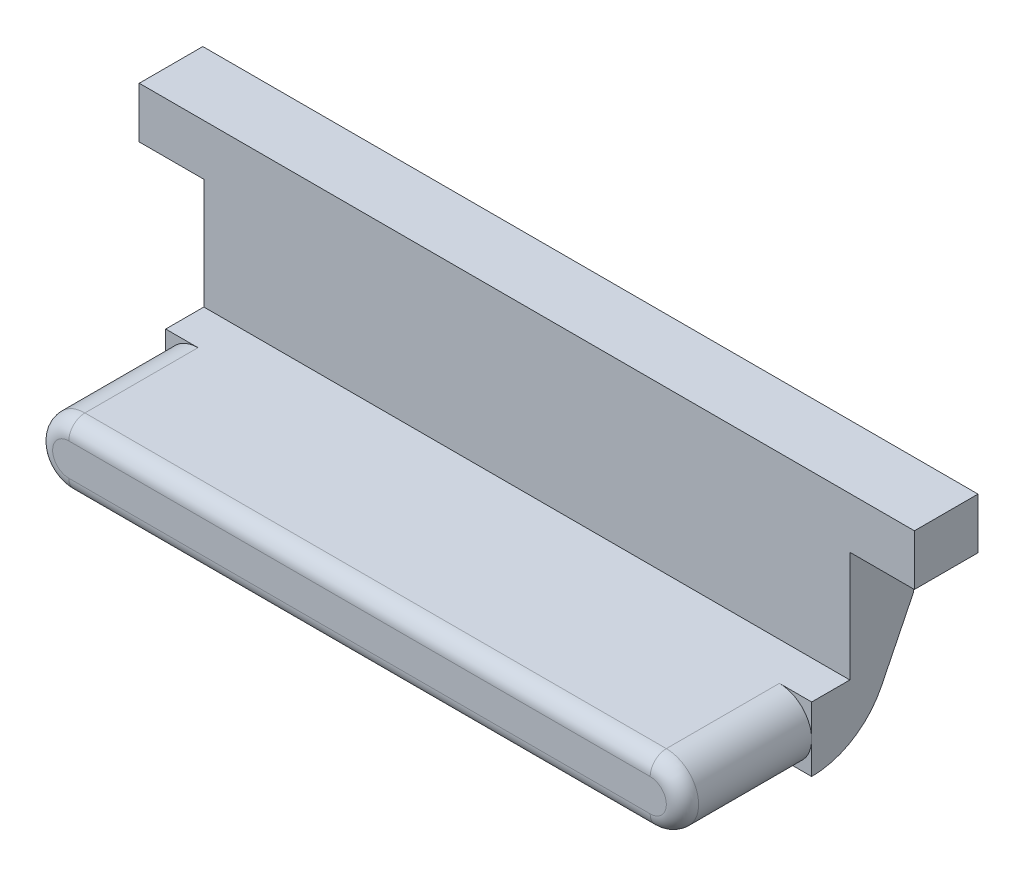
ISO-10303-21;
HEADER;
FILE_DESCRIPTION(('STEP AP214'),'2;1');
FILE_NAME('part.step','',(''),(''),'','','');
FILE_SCHEMA(('AUTOMOTIVE_DESIGN { 1 0 10303 214 1 1 1 1 }'));
ENDSEC;
DATA;
#1=APPLICATION_CONTEXT('core data for automotive mechanical design processes');
#2=APPLICATION_PROTOCOL_DEFINITION('international standard','automotive_design',2000,#1);
#3=PRODUCT_CONTEXT('',#1,'mechanical');
#4=PRODUCT('Part','Part','',(#3));
#5=PRODUCT_RELATED_PRODUCT_CATEGORY('part','',(#4));
#6=PRODUCT_DEFINITION_FORMATION('','',#4);
#7=PRODUCT_DEFINITION_CONTEXT('part definition',#1,'design');
#8=PRODUCT_DEFINITION('design','',#6,#7);
#9=PRODUCT_DEFINITION_SHAPE('','',#8);
#10=(LENGTH_UNIT() NAMED_UNIT(*) SI_UNIT(.MILLI.,.METRE.));
#11=(NAMED_UNIT(*) PLANE_ANGLE_UNIT() SI_UNIT($,.RADIAN.));
#12=(NAMED_UNIT(*) SI_UNIT($,.STERADIAN.) SOLID_ANGLE_UNIT());
#13=UNCERTAINTY_MEASURE_WITH_UNIT(LENGTH_MEASURE(1.E-05),#10,'distance_accuracy_value','');
#14=(GEOMETRIC_REPRESENTATION_CONTEXT(3) GLOBAL_UNCERTAINTY_ASSIGNED_CONTEXT((#13)) GLOBAL_UNIT_ASSIGNED_CONTEXT((#10,
#11,#12)) REPRESENTATION_CONTEXT('',''));
#15=CARTESIAN_POINT('',(0.,0.,0.));
#16=DIRECTION('',(0.,0.,1.));
#17=DIRECTION('',(1.,0.,0.));
#18=AXIS2_PLACEMENT_3D('',#15,#16,#17);
#19=CARTESIAN_POINT('',(-127.,216.547012861156,330.216510917726));
#20=DIRECTION('',(-1.,0.,0.));
#21=DIRECTION('',(0.,-1.,0.));
#22=AXIS2_PLACEMENT_3D('',#19,#20,#21);
#23=PLANE('',#22);
#24=DIRECTION('',(0.,-1.,0.));
#25=VECTOR('',#24,1.);
#26=CARTESIAN_POINT('',(-127.,190.5,340.6));
#27=LINE('',#26,#25);
#28=CARTESIAN_POINT('',(-127.,234.,340.6));
#29=VERTEX_POINT('',#28);
#30=CARTESIAN_POINT('',(-127.,190.5,340.6));
#31=VERTEX_POINT('',#30);
#32=EDGE_CURVE('E265',#29,#31,#27,.T.);
#33=ORIENTED_EDGE('',*,*,#32,.F.);
#34=DIRECTION('',(0.,0.,1.));
#35=VECTOR('',#34,1.);
#36=CARTESIAN_POINT('',(-127.,234.,315.5999992));
#37=LINE('',#36,#35);
#38=CARTESIAN_POINT('',(-127.,234.,315.5999992));
#39=VERTEX_POINT('',#38);
#40=EDGE_CURVE('E247',#39,#29,#37,.T.);
#41=ORIENTED_EDGE('',*,*,#40,.F.);
#42=DIRECTION('',(0.,1.,0.));
#43=VECTOR('',#42,1.);
#44=CARTESIAN_POINT('',(-127.,207.745235757354,315.5999992));
#45=LINE('',#44,#43);
#46=CARTESIAN_POINT('',(-127.,207.745235757354,315.5999992));
#47=VERTEX_POINT('',#46);
#48=EDGE_CURVE('E12',#47,#39,#45,.T.);
#49=ORIENTED_EDGE('',*,*,#48,.F.);
#50=DIRECTION('',(0.,-0.897542133073816,0.440928700990653));
#51=VECTOR('',#50,1.);
#52=CARTESIAN_POINT('',(-127.,165.1,336.55));
#53=LINE('',#52,#51);
#54=CARTESIAN_POINT('',(-127.,182.140493193805,328.17864644309));
#55=VERTEX_POINT('',#54);
#56=EDGE_CURVE('E270',#47,#55,#53,.T.);
#57=ORIENTED_EDGE('',*,*,#56,.T.);
#58=CARTESIAN_POINT('',(-127.,195.58,355.535730659179));
#59=DIRECTION('',(-1.,0.,0.));
#60=DIRECTION('',(0.,-1.,0.));
#61=AXIS2_PLACEMENT_3D('',#58,#59,#60);
#62=CIRCLE('',#61,30.4800000000001);
#63=CARTESIAN_POINT('',(-127.,165.1,355.535730659179));
#64=VERTEX_POINT('',#63);
#65=EDGE_CURVE('E275',#55,#64,#62,.T.);
#66=ORIENTED_EDGE('',*,*,#65,.T.);
#67=DIRECTION('',(0.,0.,1.));
#68=VECTOR('',#67,1.);
#69=CARTESIAN_POINT('',(-127.,165.1,406.4));
#70=LINE('',#69,#68);
#71=CARTESIAN_POINT('',(-127.,165.1,355.6));
#72=VERTEX_POINT('',#71);
#73=EDGE_CURVE('E278',#64,#72,#70,.T.);
#74=ORIENTED_EDGE('',*,*,#73,.T.);
#75=DIRECTION('',(0.,-1.,0.));
#76=VECTOR('',#75,1.);
#77=CARTESIAN_POINT('',(-127.,0.,355.6));
#78=LINE('',#77,#76);
#79=CARTESIAN_POINT('',(-127.,177.8,355.6));
#80=VERTEX_POINT('',#79);
#81=EDGE_CURVE('E276',#80,#72,#78,.T.);
#82=ORIENTED_EDGE('',*,*,#81,.F.);
#83=CARTESIAN_POINT('',(-127.,190.5,355.6));
#84=VERTEX_POINT('',#83);
#85=EDGE_CURVE('E272',#84,#80,#78,.T.);
#86=ORIENTED_EDGE('',*,*,#85,.F.);
#87=DIRECTION('',(0.,0.,-1.));
#88=VECTOR('',#87,1.);
#89=CARTESIAN_POINT('',(-127.,190.5,406.4));
#90=LINE('',#89,#88);
#91=EDGE_CURVE('E267',#84,#31,#90,.T.);
#92=ORIENTED_EDGE('',*,*,#91,.T.);
#93=EDGE_LOOP('',(#33,#41,#49,#57,#66,#74,#82,#86,#92));
#94=FACE_BOUND('',#93,.T.);
#95=ADVANCED_FACE('F35',(#94),#23,.T.);
#96=CARTESIAN_POINT('',(0.,0.,355.6));
#97=DIRECTION('',(0.,0.,1.));
#98=DIRECTION('',(1.,0.,0.));
#99=AXIS2_PLACEMENT_3D('',#96,#97,#98);
#100=PLANE('',#99);
#101=DIRECTION('',(-1.,0.,0.));
#102=VECTOR('',#101,1.);
#103=CARTESIAN_POINT('',(0.,190.5,355.6));
#104=LINE('',#103,#102);
#105=CARTESIAN_POINT('',(-114.3,190.5,355.6));
#106=VERTEX_POINT('',#105);
#107=EDGE_CURVE('E282',#106,#84,#104,.T.);
#108=ORIENTED_EDGE('',*,*,#107,.T.);
#109=ORIENTED_EDGE('',*,*,#85,.T.);
#110=CARTESIAN_POINT('',(-114.3,177.8,355.6));
#111=DIRECTION('',(0.,0.,1.));
#112=DIRECTION('',(1.,0.,0.));
#113=AXIS2_PLACEMENT_3D('',#110,#111,#112);
#114=CIRCLE('',#113,12.7);
#115=EDGE_CURVE('E297',#106,#80,#114,.T.);
#116=ORIENTED_EDGE('',*,*,#115,.F.);
#117=EDGE_LOOP('',(#108,#109,#116));
#118=FACE_BOUND('',#117,.T.);
#119=ADVANCED_FACE('F335',(#118),#100,.T.);
#120=CARTESIAN_POINT('',(-114.3,165.1,355.6));
#121=VERTEX_POINT('',#120);
#122=EDGE_CURVE('E301',#80,#121,#114,.T.);
#123=ORIENTED_EDGE('',*,*,#122,.F.);
#124=ORIENTED_EDGE('',*,*,#81,.T.);
#125=DIRECTION('',(1.,0.,0.));
#126=VECTOR('',#125,1.);
#127=CARTESIAN_POINT('',(-127.,165.1,355.6));
#128=LINE('',#127,#126);
#129=EDGE_CURVE('E294',#72,#121,#128,.T.);
#130=ORIENTED_EDGE('',*,*,#129,.T.);
#131=EDGE_LOOP('',(#123,#124,#130));
#132=FACE_BOUND('',#131,.T.);
#133=ADVANCED_FACE('F330',(#132),#100,.T.);
#134=CARTESIAN_POINT('',(-127.,165.1,336.55));
#135=DIRECTION('',(0.,0.440928700990653,0.897542133073816));
#136=DIRECTION('',(0.,-0.897542133073816,0.440928700990653));
#137=AXIS2_PLACEMENT_3D('',#134,#135,#136);
#138=PLANE('',#137);
#139=ORIENTED_EDGE('',*,*,#56,.F.);
#140=DIRECTION('',(1.,0.,0.));
#141=VECTOR('',#140,1.);
#142=CARTESIAN_POINT('',(-196.85,207.745235757354,315.5999992));
#143=LINE('',#142,#141);
#144=CARTESIAN_POINT('',(127.,207.745235757354,315.5999992));
#145=VERTEX_POINT('',#144);
#146=EDGE_CURVE('E286',#47,#145,#143,.T.);
#147=ORIENTED_EDGE('',*,*,#146,.T.);
#148=DIRECTION('',(0.,-0.897542133073816,0.440928700990653));
#149=VECTOR('',#148,1.);
#150=CARTESIAN_POINT('',(127.,165.1,336.55));
#151=LINE('',#150,#149);
#152=CARTESIAN_POINT('',(127.,182.140493193805,328.17864644309));
#153=VERTEX_POINT('',#152);
#154=EDGE_CURVE('E207',#145,#153,#151,.T.);
#155=ORIENTED_EDGE('',*,*,#154,.T.);
#156=DIRECTION('',(1.,0.,0.));
#157=VECTOR('',#156,1.);
#158=CARTESIAN_POINT('',(-159.230241468136,182.140493193805,328.178646443089));
#159=LINE('',#158,#157);
#160=EDGE_CURVE('E290',#55,#153,#159,.T.);
#161=ORIENTED_EDGE('',*,*,#160,.F.);
#162=EDGE_LOOP('',(#139,#147,#155,#161));
#163=FACE_BOUND('',#162,.T.);
#164=ADVANCED_FACE('F353',(#163),#138,.F.);
#165=CARTESIAN_POINT('',(-114.3,165.1,406.4));
#166=DIRECTION('',(0.,1.,0.));
#167=DIRECTION('',(-1.,0.,0.));
#168=AXIS2_PLACEMENT_3D('',#165,#166,#167);
#169=PLANE('',#168);
#170=ORIENTED_EDGE('',*,*,#73,.F.);
#171=DIRECTION('',(1.,0.,0.));
#172=VECTOR('',#171,1.);
#173=CARTESIAN_POINT('',(-159.230241468136,165.1,355.535730659179));
#174=LINE('',#173,#172);
#175=CARTESIAN_POINT('',(127.,165.1,355.535730659179));
#176=VERTEX_POINT('',#175);
#177=EDGE_CURVE('E292',#64,#176,#174,.T.);
#178=ORIENTED_EDGE('',*,*,#177,.T.);
#179=DIRECTION('',(0.,0.,1.));
#180=VECTOR('',#179,1.);
#181=CARTESIAN_POINT('',(127.,165.1,406.4));
#182=LINE('',#181,#180);
#183=CARTESIAN_POINT('',(127.,165.1,355.6));
#184=VERTEX_POINT('',#183);
#185=EDGE_CURVE('E217',#176,#184,#182,.T.);
#186=ORIENTED_EDGE('',*,*,#185,.T.);
#187=DIRECTION('',(-1.,0.,0.));
#188=VECTOR('',#187,1.);
#189=CARTESIAN_POINT('',(127.,165.1,355.6));
#190=LINE('',#189,#188);
#191=CARTESIAN_POINT('',(114.3,165.1,355.6));
#192=VERTEX_POINT('',#191);
#193=EDGE_CURVE('E222',#184,#192,#190,.T.);
#194=ORIENTED_EDGE('',*,*,#193,.T.);
#195=DIRECTION('',(0.,0.,-1.));
#196=VECTOR('',#195,1.);
#197=CARTESIAN_POINT('',(114.3,165.1,406.4));
#198=LINE('',#197,#196);
#199=CARTESIAN_POINT('',(114.3,165.1,400.05));
#200=VERTEX_POINT('',#199);
#201=EDGE_CURVE('E232',#200,#192,#198,.T.);
#202=ORIENTED_EDGE('',*,*,#201,.F.);
#203=DIRECTION('',(1.,0.,0.));
#204=VECTOR('',#203,1.);
#205=CARTESIAN_POINT('',(-114.3,165.1,400.05));
#206=LINE('',#205,#204);
#207=CARTESIAN_POINT('',(-114.3,165.1,400.05));
#208=VERTEX_POINT('',#207);
#209=EDGE_CURVE('E58',#200,#208,#206,.F.);
#210=ORIENTED_EDGE('',*,*,#209,.T.);
#211=DIRECTION('',(0.,0.,-1.));
#212=VECTOR('',#211,1.);
#213=CARTESIAN_POINT('',(-114.3,165.1,406.4));
#214=LINE('',#213,#212);
#215=EDGE_CURVE('E303',#208,#121,#214,.T.);
#216=ORIENTED_EDGE('',*,*,#215,.T.);
#217=ORIENTED_EDGE('',*,*,#129,.F.);
#218=EDGE_LOOP('',(#170,#178,#186,#194,#202,#210,#216,#217));
#219=FACE_BOUND('',#218,.T.);
#220=ADVANCED_FACE('F328',(#219),#169,.F.);
#221=CARTESIAN_POINT('',(-114.3,190.5,406.4));
#222=DIRECTION('',(0.,-1.,0.));
#223=DIRECTION('',(1.,0.,0.));
#224=AXIS2_PLACEMENT_3D('',#221,#222,#223);
#225=PLANE('',#224);
#226=ORIENTED_EDGE('',*,*,#91,.F.);
#227=ORIENTED_EDGE('',*,*,#107,.F.);
#228=DIRECTION('',(0.,0.,-1.));
#229=VECTOR('',#228,1.);
#230=CARTESIAN_POINT('',(-114.3,190.5,406.4));
#231=LINE('',#230,#229);
#232=CARTESIAN_POINT('',(-114.3,190.5,400.05));
#233=VERTEX_POINT('',#232);
#234=EDGE_CURVE('E300',#233,#106,#231,.T.);
#235=ORIENTED_EDGE('',*,*,#234,.F.);
#236=DIRECTION('',(-1.,0.,0.));
#237=VECTOR('',#236,1.);
#238=CARTESIAN_POINT('',(114.3,190.5,400.05));
#239=LINE('',#238,#237);
#240=CARTESIAN_POINT('',(114.3,190.5,400.05));
#241=VERTEX_POINT('',#240);
#242=EDGE_CURVE('E43',#233,#241,#239,.F.);
#243=ORIENTED_EDGE('',*,*,#242,.T.);
#244=DIRECTION('',(0.,0.,-1.));
#245=VECTOR('',#244,1.);
#246=CARTESIAN_POINT('',(114.3,190.5,406.4));
#247=LINE('',#246,#245);
#248=CARTESIAN_POINT('',(114.3,190.5,355.6));
#249=VERTEX_POINT('',#248);
#250=EDGE_CURVE('E229',#241,#249,#247,.T.);
#251=ORIENTED_EDGE('',*,*,#250,.T.);
#252=DIRECTION('',(1.,0.,0.));
#253=VECTOR('',#252,1.);
#254=CARTESIAN_POINT('',(0.,190.5,355.6));
#255=LINE('',#254,#253);
#256=CARTESIAN_POINT('',(127.,190.5,355.6));
#257=VERTEX_POINT('',#256);
#258=EDGE_CURVE('E220',#249,#257,#255,.T.);
#259=ORIENTED_EDGE('',*,*,#258,.T.);
#260=DIRECTION('',(0.,0.,-1.));
#261=VECTOR('',#260,1.);
#262=CARTESIAN_POINT('',(127.,190.5,406.4));
#263=LINE('',#262,#261);
#264=CARTESIAN_POINT('',(127.,190.5,340.6));
#265=VERTEX_POINT('',#264);
#266=EDGE_CURVE('E204',#257,#265,#263,.T.);
#267=ORIENTED_EDGE('',*,*,#266,.T.);
#268=DIRECTION('',(1.,0.,0.));
#269=VECTOR('',#268,1.);
#270=CARTESIAN_POINT('',(-196.85,190.5,340.6));
#271=LINE('',#270,#269);
#272=EDGE_CURVE('E280',#31,#265,#271,.T.);
#273=ORIENTED_EDGE('',*,*,#272,.F.);
#274=EDGE_LOOP('',(#226,#227,#235,#243,#251,#259,#267,#273));
#275=FACE_BOUND('',#274,.T.);
#276=ADVANCED_FACE('F337',(#275),#225,.F.);
#277=CARTESIAN_POINT('',(-159.230241468136,195.58,355.535730659179));
#278=DIRECTION('',(1.,0.,0.));
#279=DIRECTION('',(0.,0.,-1.));
#280=AXIS2_PLACEMENT_3D('',#277,#278,#279);
#281=CYLINDRICAL_SURFACE('',#280,30.4800000000001);
#282=ORIENTED_EDGE('',*,*,#65,.F.);
#283=ORIENTED_EDGE('',*,*,#160,.T.);
#284=CARTESIAN_POINT('',(127.,195.58,355.535730659179));
#285=DIRECTION('',(-1.,0.,0.));
#286=DIRECTION('',(0.,-1.,0.));
#287=AXIS2_PLACEMENT_3D('',#284,#285,#286);
#288=CIRCLE('',#287,30.4800000000001);
#289=EDGE_CURVE('E213',#153,#176,#288,.T.);
#290=ORIENTED_EDGE('',*,*,#289,.T.);
#291=ORIENTED_EDGE('',*,*,#177,.F.);
#292=EDGE_LOOP('',(#282,#283,#290,#291));
#293=FACE_BOUND('',#292,.T.);
#294=ADVANCED_FACE('F357',(#293),#281,.T.);
#295=CARTESIAN_POINT('',(-196.85,190.5,340.6));
#296=DIRECTION('',(0.,0.,1.));
#297=DIRECTION('',(1.,0.,0.));
#298=AXIS2_PLACEMENT_3D('',#295,#296,#297);
#299=PLANE('',#298);
#300=DIRECTION('',(1.,0.,0.));
#301=VECTOR('',#300,1.);
#302=CARTESIAN_POINT('',(-196.85,254.,340.6));
#303=LINE('',#302,#301);
#304=CARTESIAN_POINT('',(-152.4,254.,340.6));
#305=VERTEX_POINT('',#304);
#306=CARTESIAN_POINT('',(152.4,254.,340.6));
#307=VERTEX_POINT('',#306);
#308=EDGE_CURVE('E283',#305,#307,#303,.T.);
#309=ORIENTED_EDGE('',*,*,#308,.F.);
#310=DIRECTION('',(0.,1.,0.));
#311=VECTOR('',#310,1.);
#312=CARTESIAN_POINT('',(-152.4,254.,340.6));
#313=LINE('',#312,#311);
#314=CARTESIAN_POINT('',(-152.4,234.,340.6));
#315=VERTEX_POINT('',#314);
#316=EDGE_CURVE('E253',#315,#305,#313,.T.);
#317=ORIENTED_EDGE('',*,*,#316,.F.);
#318=DIRECTION('',(1.,0.,0.));
#319=VECTOR('',#318,1.);
#320=CARTESIAN_POINT('',(-152.4,234.,340.6));
#321=LINE('',#320,#319);
#322=EDGE_CURVE('E259',#315,#29,#321,.T.);
#323=ORIENTED_EDGE('',*,*,#322,.T.);
#324=ORIENTED_EDGE('',*,*,#32,.T.);
#325=ORIENTED_EDGE('',*,*,#272,.T.);
#326=DIRECTION('',(0.,-1.,0.));
#327=VECTOR('',#326,1.);
#328=CARTESIAN_POINT('',(127.,190.5,340.6));
#329=LINE('',#328,#327);
#330=CARTESIAN_POINT('',(127.,234.,340.6));
#331=VERTEX_POINT('',#330);
#332=EDGE_CURVE('E188',#331,#265,#329,.T.);
#333=ORIENTED_EDGE('',*,*,#332,.F.);
#334=DIRECTION('',(-1.,0.,0.));
#335=VECTOR('',#334,1.);
#336=CARTESIAN_POINT('',(152.4,234.,340.6));
#337=LINE('',#336,#335);
#338=CARTESIAN_POINT('',(152.4,234.,340.6));
#339=VERTEX_POINT('',#338);
#340=EDGE_CURVE('E189',#339,#331,#337,.T.);
#341=ORIENTED_EDGE('',*,*,#340,.F.);
#342=DIRECTION('',(0.,1.,0.));
#343=VECTOR('',#342,1.);
#344=CARTESIAN_POINT('',(152.4,254.,340.6));
#345=LINE('',#344,#343);
#346=EDGE_CURVE('E176',#339,#307,#345,.T.);
#347=ORIENTED_EDGE('',*,*,#346,.T.);
#348=EDGE_LOOP('',(#309,#317,#323,#324,#325,#333,#341,#347));
#349=FACE_BOUND('',#348,.T.);
#350=ADVANCED_FACE('F342',(#349),#299,.T.);
#351=CARTESIAN_POINT('',(-196.85,254.,340.6));
#352=DIRECTION('',(0.,1.,0.));
#353=DIRECTION('',(0.,0.,1.));
#354=AXIS2_PLACEMENT_3D('',#351,#352,#353);
#355=PLANE('',#354);
#356=DIRECTION('',(1.,0.,0.));
#357=VECTOR('',#356,1.);
#358=CARTESIAN_POINT('',(-196.85,254.,315.5999992));
#359=LINE('',#358,#357);
#360=CARTESIAN_POINT('',(-152.4,254.,315.5999992));
#361=VERTEX_POINT('',#360);
#362=CARTESIAN_POINT('',(152.4,254.,315.5999992));
#363=VERTEX_POINT('',#362);
#364=EDGE_CURVE('E194',#361,#363,#359,.T.);
#365=ORIENTED_EDGE('',*,*,#364,.F.);
#366=DIRECTION('',(0.,0.,-1.));
#367=VECTOR('',#366,1.);
#368=CARTESIAN_POINT('',(-152.4,254.,315.5999992));
#369=LINE('',#368,#367);
#370=EDGE_CURVE('E256',#305,#361,#369,.T.);
#371=ORIENTED_EDGE('',*,*,#370,.F.);
#372=ORIENTED_EDGE('',*,*,#308,.T.);
#373=DIRECTION('',(0.,0.,-1.));
#374=VECTOR('',#373,1.);
#375=CARTESIAN_POINT('',(152.4,254.,315.5999992));
#376=LINE('',#375,#374);
#377=EDGE_CURVE('E199',#307,#363,#376,.T.);
#378=ORIENTED_EDGE('',*,*,#377,.T.);
#379=EDGE_LOOP('',(#365,#371,#372,#378));
#380=FACE_BOUND('',#379,.T.);
#381=ADVANCED_FACE('F407',(#380),#355,.T.);
#382=CARTESIAN_POINT('',(-196.85,207.745235757354,315.5999992));
#383=DIRECTION('',(0.,0.,-1.));
#384=DIRECTION('',(-1.,0.,0.));
#385=AXIS2_PLACEMENT_3D('',#382,#383,#384);
#386=PLANE('',#385);
#387=ORIENTED_EDGE('',*,*,#146,.F.);
#388=ORIENTED_EDGE('',*,*,#48,.T.);
#389=DIRECTION('',(1.,0.,0.));
#390=VECTOR('',#389,1.);
#391=CARTESIAN_POINT('',(-152.4,234.,315.5999992));
#392=LINE('',#391,#390);
#393=CARTESIAN_POINT('',(-152.4,234.,315.5999992));
#394=VERTEX_POINT('',#393);
#395=EDGE_CURVE('E263',#394,#39,#392,.T.);
#396=ORIENTED_EDGE('',*,*,#395,.F.);
#397=DIRECTION('',(0.,-1.,0.));
#398=VECTOR('',#397,1.);
#399=CARTESIAN_POINT('',(-152.4,254.,315.5999992));
#400=LINE('',#399,#398);
#401=EDGE_CURVE('E248',#361,#394,#400,.T.);
#402=ORIENTED_EDGE('',*,*,#401,.F.);
#403=ORIENTED_EDGE('',*,*,#364,.T.);
#404=DIRECTION('',(0.,-1.,0.));
#405=VECTOR('',#404,1.);
#406=CARTESIAN_POINT('',(152.4,254.,315.5999992));
#407=LINE('',#406,#405);
#408=CARTESIAN_POINT('',(152.4,234.,315.5999992));
#409=VERTEX_POINT('',#408);
#410=EDGE_CURVE('E173',#363,#409,#407,.T.);
#411=ORIENTED_EDGE('',*,*,#410,.T.);
#412=DIRECTION('',(-1.,0.,0.));
#413=VECTOR('',#412,1.);
#414=CARTESIAN_POINT('',(152.4,234.,315.5999992));
#415=LINE('',#414,#413);
#416=CARTESIAN_POINT('',(127.,234.,315.5999992));
#417=VERTEX_POINT('',#416);
#418=EDGE_CURVE('E181',#409,#417,#415,.T.);
#419=ORIENTED_EDGE('',*,*,#418,.T.);
#420=DIRECTION('',(0.,1.,0.));
#421=VECTOR('',#420,1.);
#422=CARTESIAN_POINT('',(127.,207.745235757354,315.5999992));
#423=LINE('',#422,#421);
#424=EDGE_CURVE('E240',#145,#417,#423,.T.);
#425=ORIENTED_EDGE('',*,*,#424,.F.);
#426=EDGE_LOOP('',(#387,#388,#396,#402,#403,#411,#419,#425));
#427=FACE_BOUND('',#426,.T.);
#428=ADVANCED_FACE('F192',(#427),#386,.T.);
#429=CARTESIAN_POINT('',(-114.3,177.8,406.4));
#430=DIRECTION('',(0.,0.,1.));
#431=DIRECTION('',(1.,0.,0.));
#432=AXIS2_PLACEMENT_3D('',#429,#430,#431);
#433=PLANE('',#432);
#434=DIRECTION('',(1.,0.,0.));
#435=VECTOR('',#434,1.);
#436=CARTESIAN_POINT('',(114.3,171.45,406.4));
#437=LINE('',#436,#435);
#438=CARTESIAN_POINT('',(-114.3,171.45,406.4));
#439=VERTEX_POINT('',#438);
#440=CARTESIAN_POINT('',(114.3,171.45,406.4));
#441=VERTEX_POINT('',#440);
#442=EDGE_CURVE('E309',#439,#441,#437,.T.);
#443=ORIENTED_EDGE('',*,*,#442,.T.);
#444=CARTESIAN_POINT('',(114.3,177.8,406.4));
#445=DIRECTION('',(0.,0.,-1.));
#446=DIRECTION('',(-1.,0.,0.));
#447=AXIS2_PLACEMENT_3D('',#444,#445,#446);
#448=CIRCLE('',#447,6.34999999999996);
#449=CARTESIAN_POINT('',(114.3,184.15,406.4));
#450=VERTEX_POINT('',#449);
#451=EDGE_CURVE('E234',#450,#441,#448,.T.);
#452=ORIENTED_EDGE('',*,*,#451,.F.);
#453=DIRECTION('',(-1.,0.,0.));
#454=VECTOR('',#453,1.);
#455=CARTESIAN_POINT('',(-114.3,184.15,406.4));
#456=LINE('',#455,#454);
#457=CARTESIAN_POINT('',(-114.3,184.15,406.4));
#458=VERTEX_POINT('',#457);
#459=EDGE_CURVE('E305',#450,#458,#456,.T.);
#460=ORIENTED_EDGE('',*,*,#459,.T.);
#461=CARTESIAN_POINT('',(-114.3,177.8,406.4));
#462=DIRECTION('',(0.,0.,1.));
#463=DIRECTION('',(1.,0.,0.));
#464=AXIS2_PLACEMENT_3D('',#461,#462,#463);
#465=CIRCLE('',#464,6.34999999999996);
#466=EDGE_CURVE('E307',#458,#439,#465,.T.);
#467=ORIENTED_EDGE('',*,*,#466,.T.);
#468=EDGE_LOOP('',(#443,#452,#460,#467));
#469=FACE_BOUND('',#468,.T.);
#470=ADVANCED_FACE('F384',(#469),#433,.T.);
#471=CARTESIAN_POINT('',(-114.3,171.45,400.05));
#472=DIRECTION('',(-1.,0.,0.));
#473=DIRECTION('',(0.,-1.,0.));
#474=AXIS2_PLACEMENT_3D('',#471,#472,#473);
#475=CYLINDRICAL_SURFACE('',#474,6.35);
#476=ORIENTED_EDGE('',*,*,#209,.F.);
#477=CARTESIAN_POINT('',(114.3,171.45,400.05));
#478=DIRECTION('',(1.,0.,0.));
#479=DIRECTION('',(0.,0.,-1.));
#480=AXIS2_PLACEMENT_3D('',#477,#478,#479);
#481=CIRCLE('',#480,6.35);
#482=EDGE_CURVE('E243',#441,#200,#481,.T.);
#483=ORIENTED_EDGE('',*,*,#482,.F.);
#484=ORIENTED_EDGE('',*,*,#442,.F.);
#485=CARTESIAN_POINT('',(-114.3,171.45,400.05));
#486=DIRECTION('',(1.,0.,0.));
#487=DIRECTION('',(0.,0.,-1.));
#488=AXIS2_PLACEMENT_3D('',#485,#486,#487);
#489=CIRCLE('',#488,6.35);
#490=EDGE_CURVE('E315',#439,#208,#489,.T.);
#491=ORIENTED_EDGE('',*,*,#490,.T.);
#492=EDGE_LOOP('',(#476,#483,#484,#491));
#493=FACE_BOUND('',#492,.T.);
#494=ADVANCED_FACE('F382',(#493),#475,.T.);
#495=CARTESIAN_POINT('',(-114.3,184.15,400.05));
#496=DIRECTION('',(1.,0.,0.));
#497=DIRECTION('',(0.,1.,0.));
#498=AXIS2_PLACEMENT_3D('',#495,#496,#497);
#499=CYLINDRICAL_SURFACE('',#498,6.35);
#500=ORIENTED_EDGE('',*,*,#459,.F.);
#501=CARTESIAN_POINT('',(114.3,184.15,400.05));
#502=DIRECTION('',(1.,0.,0.));
#503=DIRECTION('',(0.,0.,-1.));
#504=AXIS2_PLACEMENT_3D('',#501,#502,#503);
#505=CIRCLE('',#504,6.35);
#506=EDGE_CURVE('E225',#241,#450,#505,.T.);
#507=ORIENTED_EDGE('',*,*,#506,.F.);
#508=ORIENTED_EDGE('',*,*,#242,.F.);
#509=CARTESIAN_POINT('',(-114.3,184.15,400.05));
#510=DIRECTION('',(1.,0.,0.));
#511=DIRECTION('',(0.,0.,-1.));
#512=AXIS2_PLACEMENT_3D('',#509,#510,#511);
#513=CIRCLE('',#512,6.35);
#514=EDGE_CURVE('E296',#233,#458,#513,.T.);
#515=ORIENTED_EDGE('',*,*,#514,.T.);
#516=EDGE_LOOP('',(#500,#507,#508,#515));
#517=FACE_BOUND('',#516,.T.);
#518=ADVANCED_FACE('F388',(#517),#499,.T.);
#519=CARTESIAN_POINT('',(-114.3,177.8,406.4));
#520=DIRECTION('',(0.,0.,-1.));
#521=DIRECTION('',(-1.,0.,0.));
#522=AXIS2_PLACEMENT_3D('',#519,#520,#521);
#523=CYLINDRICAL_SURFACE('',#522,12.7);
#524=CARTESIAN_POINT('',(-114.3,177.8,400.05));
#525=DIRECTION('',(0.,0.,1.));
#526=DIRECTION('',(1.,0.,0.));
#527=AXIS2_PLACEMENT_3D('',#524,#525,#526);
#528=CIRCLE('',#527,12.7);
#529=EDGE_CURVE('E50',#208,#233,#528,.F.);
#530=ORIENTED_EDGE('',*,*,#529,.T.);
#531=ORIENTED_EDGE('',*,*,#234,.T.);
#532=ORIENTED_EDGE('',*,*,#115,.T.);
#533=ORIENTED_EDGE('',*,*,#122,.T.);
#534=ORIENTED_EDGE('',*,*,#215,.F.);
#535=EDGE_LOOP('',(#530,#531,#532,#533,#534));
#536=FACE_BOUND('',#535,.T.);
#537=ADVANCED_FACE('F322',(#536),#523,.T.);
#538=CARTESIAN_POINT('',(-114.3,177.8,400.05));
#539=DIRECTION('',(0.,0.,1.));
#540=DIRECTION('',(1.,0.,0.));
#541=AXIS2_PLACEMENT_3D('',#538,#539,#540);
#542=DEGENERATE_TOROIDAL_SURFACE('',#541,6.34999999999996,6.35,.T.);
#543=ORIENTED_EDGE('',*,*,#514,.F.);
#544=ORIENTED_EDGE('',*,*,#529,.F.);
#545=ORIENTED_EDGE('',*,*,#490,.F.);
#546=ORIENTED_EDGE('',*,*,#466,.F.);
#547=EDGE_LOOP('',(#543,#544,#545,#546));
#548=FACE_BOUND('',#547,.T.);
#549=ADVANCED_FACE('F37',(#548),#542,.T.);
#550=CARTESIAN_POINT('',(-152.4,234.,315.5999992));
#551=DIRECTION('',(0.,1.,0.));
#552=DIRECTION('',(-1.,0.,0.));
#553=AXIS2_PLACEMENT_3D('',#550,#551,#552);
#554=PLANE('',#553);
#555=ORIENTED_EDGE('',*,*,#40,.T.);
#556=ORIENTED_EDGE('',*,*,#322,.F.);
#557=DIRECTION('',(0.,0.,1.));
#558=VECTOR('',#557,1.);
#559=CARTESIAN_POINT('',(-152.4,234.,315.5999992));
#560=LINE('',#559,#558);
#561=EDGE_CURVE('E251',#394,#315,#560,.T.);
#562=ORIENTED_EDGE('',*,*,#561,.F.);
#563=ORIENTED_EDGE('',*,*,#395,.T.);
#564=EDGE_LOOP('',(#555,#556,#562,#563));
#565=FACE_BOUND('',#564,.T.);
#566=ADVANCED_FACE('F347',(#565),#554,.F.);
#567=CARTESIAN_POINT('',(-152.4,0.,0.));
#568=DIRECTION('',(-1.,0.,0.));
#569=DIRECTION('',(0.,0.,1.));
#570=AXIS2_PLACEMENT_3D('',#567,#568,#569);
#571=PLANE('',#570);
#572=ORIENTED_EDGE('',*,*,#401,.T.);
#573=ORIENTED_EDGE('',*,*,#561,.T.);
#574=ORIENTED_EDGE('',*,*,#316,.T.);
#575=ORIENTED_EDGE('',*,*,#370,.T.);
#576=EDGE_LOOP('',(#572,#573,#574,#575));
#577=FACE_BOUND('',#576,.T.);
#578=ADVANCED_FACE('F470',(#577),#571,.T.);
#579=CARTESIAN_POINT('',(127.,216.547012861156,330.216510917726));
#580=DIRECTION('',(1.,0.,0.));
#581=DIRECTION('',(0.,-1.,0.));
#582=AXIS2_PLACEMENT_3D('',#579,#580,#581);
#583=PLANE('',#582);
#584=ORIENTED_EDGE('',*,*,#332,.T.);
#585=ORIENTED_EDGE('',*,*,#266,.F.);
#586=DIRECTION('',(0.,-1.,0.));
#587=VECTOR('',#586,1.);
#588=CARTESIAN_POINT('',(127.,0.,355.6));
#589=LINE('',#588,#587);
#590=CARTESIAN_POINT('',(127.,177.8,355.6));
#591=VERTEX_POINT('',#590);
#592=EDGE_CURVE('E210',#257,#591,#589,.T.);
#593=ORIENTED_EDGE('',*,*,#592,.T.);
#594=EDGE_CURVE('E214',#591,#184,#589,.T.);
#595=ORIENTED_EDGE('',*,*,#594,.T.);
#596=ORIENTED_EDGE('',*,*,#185,.F.);
#597=ORIENTED_EDGE('',*,*,#289,.F.);
#598=ORIENTED_EDGE('',*,*,#154,.F.);
#599=ORIENTED_EDGE('',*,*,#424,.T.);
#600=DIRECTION('',(0.,0.,1.));
#601=VECTOR('',#600,1.);
#602=CARTESIAN_POINT('',(127.,234.,315.5999992));
#603=LINE('',#602,#601);
#604=EDGE_CURVE('E184',#417,#331,#603,.T.);
#605=ORIENTED_EDGE('',*,*,#604,.T.);
#606=EDGE_LOOP('',(#584,#585,#593,#595,#596,#597,#598,#599,#605));
#607=FACE_BOUND('',#606,.T.);
#608=ADVANCED_FACE('F363',(#607),#583,.T.);
#609=CARTESIAN_POINT('',(0.,0.,355.6));
#610=DIRECTION('',(0.,0.,1.));
#611=DIRECTION('',(-1.,0.,0.));
#612=AXIS2_PLACEMENT_3D('',#609,#610,#611);
#613=PLANE('',#612);
#614=ORIENTED_EDGE('',*,*,#258,.F.);
#615=CARTESIAN_POINT('',(114.3,177.8,355.6));
#616=DIRECTION('',(0.,0.,-1.));
#617=DIRECTION('',(-1.,0.,0.));
#618=AXIS2_PLACEMENT_3D('',#615,#616,#617);
#619=CIRCLE('',#618,12.7);
#620=EDGE_CURVE('E226',#249,#591,#619,.T.);
#621=ORIENTED_EDGE('',*,*,#620,.T.);
#622=ORIENTED_EDGE('',*,*,#592,.F.);
#623=EDGE_LOOP('',(#614,#621,#622));
#624=FACE_BOUND('',#623,.T.);
#625=ADVANCED_FACE('F375',(#624),#613,.T.);
#626=EDGE_CURVE('E230',#591,#192,#619,.T.);
#627=ORIENTED_EDGE('',*,*,#626,.T.);
#628=ORIENTED_EDGE('',*,*,#193,.F.);
#629=ORIENTED_EDGE('',*,*,#594,.F.);
#630=EDGE_LOOP('',(#627,#628,#629));
#631=FACE_BOUND('',#630,.T.);
#632=ADVANCED_FACE('F367',(#631),#613,.T.);
#633=CARTESIAN_POINT('',(114.3,177.8,406.4));
#634=DIRECTION('',(0.,0.,-1.));
#635=DIRECTION('',(1.,0.,0.));
#636=AXIS2_PLACEMENT_3D('',#633,#634,#635);
#637=CYLINDRICAL_SURFACE('',#636,12.7);
#638=CARTESIAN_POINT('',(114.3,177.8,400.05));
#639=DIRECTION('',(0.,0.,-1.));
#640=DIRECTION('',(-1.,0.,0.));
#641=AXIS2_PLACEMENT_3D('',#638,#639,#640);
#642=CIRCLE('',#641,12.7);
#643=EDGE_CURVE('E237',#200,#241,#642,.F.);
#644=ORIENTED_EDGE('',*,*,#643,.F.);
#645=ORIENTED_EDGE('',*,*,#201,.T.);
#646=ORIENTED_EDGE('',*,*,#626,.F.);
#647=ORIENTED_EDGE('',*,*,#620,.F.);
#648=ORIENTED_EDGE('',*,*,#250,.F.);
#649=EDGE_LOOP('',(#644,#645,#646,#647,#648));
#650=FACE_BOUND('',#649,.T.);
#651=ADVANCED_FACE('F371',(#650),#637,.T.);
#652=CARTESIAN_POINT('',(114.3,177.8,400.05));
#653=DIRECTION('',(0.,0.,1.));
#654=DIRECTION('',(-1.,0.,0.));
#655=AXIS2_PLACEMENT_3D('',#652,#653,#654);
#656=DEGENERATE_TOROIDAL_SURFACE('',#655,6.34999999999996,6.35,.T.);
#657=ORIENTED_EDGE('',*,*,#506,.T.);
#658=ORIENTED_EDGE('',*,*,#451,.T.);
#659=ORIENTED_EDGE('',*,*,#482,.T.);
#660=ORIENTED_EDGE('',*,*,#643,.T.);
#661=EDGE_LOOP('',(#657,#658,#659,#660));
#662=FACE_BOUND('',#661,.T.);
#663=ADVANCED_FACE('F380',(#662),#656,.T.);
#664=CARTESIAN_POINT('',(152.4,234.,315.5999992));
#665=DIRECTION('',(0.,1.,0.));
#666=DIRECTION('',(1.,0.,0.));
#667=AXIS2_PLACEMENT_3D('',#664,#665,#666);
#668=PLANE('',#667);
#669=ORIENTED_EDGE('',*,*,#604,.F.);
#670=ORIENTED_EDGE('',*,*,#418,.F.);
#671=DIRECTION('',(0.,0.,1.));
#672=VECTOR('',#671,1.);
#673=CARTESIAN_POINT('',(152.4,234.,315.5999992));
#674=LINE('',#673,#672);
#675=EDGE_CURVE('E168',#409,#339,#674,.T.);
#676=ORIENTED_EDGE('',*,*,#675,.T.);
#677=ORIENTED_EDGE('',*,*,#340,.T.);
#678=EDGE_LOOP('',(#669,#670,#676,#677));
#679=FACE_BOUND('',#678,.T.);
#680=ADVANCED_FACE('F182',(#679),#668,.F.);
#681=CARTESIAN_POINT('',(152.4,0.,0.));
#682=DIRECTION('',(1.,0.,0.));
#683=DIRECTION('',(0.,0.,1.));
#684=AXIS2_PLACEMENT_3D('',#681,#682,#683);
#685=PLANE('',#684);
#686=ORIENTED_EDGE('',*,*,#410,.F.);
#687=ORIENTED_EDGE('',*,*,#377,.F.);
#688=ORIENTED_EDGE('',*,*,#346,.F.);
#689=ORIENTED_EDGE('',*,*,#675,.F.);
#690=EDGE_LOOP('',(#686,#687,#688,#689));
#691=FACE_BOUND('',#690,.T.);
#692=ADVANCED_FACE('F170',(#691),#685,.T.);
#693=CLOSED_SHELL('',(#95,#119,#133,#164,#220,#276,#294,#350,#381,#428,#470,#494,#518,#537,#549,
#566,#578,#608,#625,#632,#651,#663,#680,#692));
#694=MANIFOLD_SOLID_BREP('B2',#693);
#695=ADVANCED_BREP_SHAPE_REPRESENTATION('',(#18,#694),#14);
#696=SHAPE_DEFINITION_REPRESENTATION(#9,#695);
ENDSEC;
END-ISO-10303-21;
